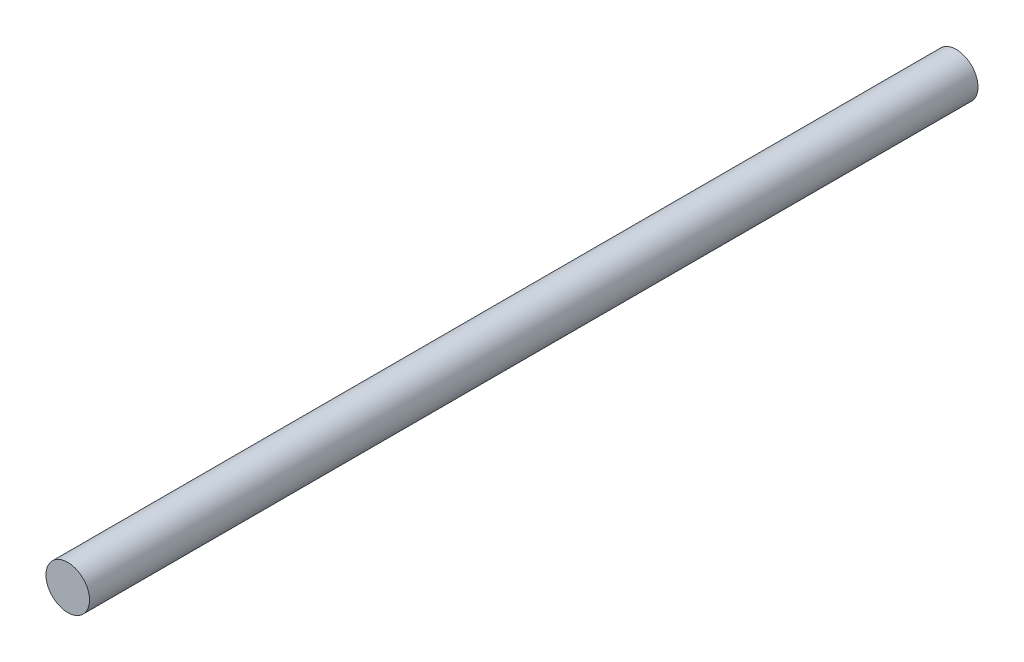
ISO-10303-21;
HEADER;
FILE_DESCRIPTION(('STEP AP214'),'2;1');
FILE_NAME('part.step','',(''),(''),'','','');
FILE_SCHEMA(('AUTOMOTIVE_DESIGN { 1 0 10303 214 1 1 1 1 }'));
ENDSEC;
DATA;
#1=APPLICATION_CONTEXT('core data for automotive mechanical design processes');
#2=APPLICATION_PROTOCOL_DEFINITION('international standard','automotive_design',2000,#1);
#3=PRODUCT_CONTEXT('',#1,'mechanical');
#4=PRODUCT('Part','Part','',(#3));
#5=PRODUCT_RELATED_PRODUCT_CATEGORY('part','',(#4));
#6=PRODUCT_DEFINITION_FORMATION('','',#4);
#7=PRODUCT_DEFINITION_CONTEXT('part definition',#1,'design');
#8=PRODUCT_DEFINITION('design','',#6,#7);
#9=PRODUCT_DEFINITION_SHAPE('','',#8);
#10=(LENGTH_UNIT() NAMED_UNIT(*) SI_UNIT(.MILLI.,.METRE.));
#11=(NAMED_UNIT(*) PLANE_ANGLE_UNIT() SI_UNIT($,.RADIAN.));
#12=(NAMED_UNIT(*) SI_UNIT($,.STERADIAN.) SOLID_ANGLE_UNIT());
#13=UNCERTAINTY_MEASURE_WITH_UNIT(LENGTH_MEASURE(1.E-05),#10,'distance_accuracy_value','');
#14=(GEOMETRIC_REPRESENTATION_CONTEXT(3) GLOBAL_UNCERTAINTY_ASSIGNED_CONTEXT((#13)) GLOBAL_UNIT_ASSIGNED_CONTEXT((#10,
#11,#12)) REPRESENTATION_CONTEXT('',''));
#15=CARTESIAN_POINT('',(0.,0.,0.));
#16=DIRECTION('',(0.,0.,1.));
#17=DIRECTION('',(1.,0.,0.));
#18=AXIS2_PLACEMENT_3D('',#15,#16,#17);
#19=CARTESIAN_POINT('',(0.,0.,-102.));
#20=DIRECTION('',(0.,0.,1.));
#21=DIRECTION('',(1.,0.,0.));
#22=AXIS2_PLACEMENT_3D('',#19,#20,#21);
#23=CYLINDRICAL_SURFACE('',#22,2.5);
#24=CARTESIAN_POINT('',(0.,0.,-102.));
#25=DIRECTION('',(0.,0.,1.));
#26=DIRECTION('',(1.,0.,0.));
#27=AXIS2_PLACEMENT_3D('',#24,#25,#26);
#28=CIRCLE('',#27,2.5);
#29=CARTESIAN_POINT('',(2.5,0.,-102.));
#30=VERTEX_POINT('',#29);
#31=EDGE_CURVE('E10',#30,#30,#28,.T.);
#32=ORIENTED_EDGE('',*,*,#31,.T.);
#33=EDGE_LOOP('',(#32));
#34=FACE_BOUND('',#33,.T.);
#35=CARTESIAN_POINT('',(0.,0.,0.));
#36=DIRECTION('',(0.,0.,1.));
#37=DIRECTION('',(1.,0.,0.));
#38=AXIS2_PLACEMENT_3D('',#35,#36,#37);
#39=CIRCLE('',#38,2.5);
#40=CARTESIAN_POINT('',(2.5,0.,0.));
#41=VERTEX_POINT('',#40);
#42=EDGE_CURVE('E34',#41,#41,#39,.T.);
#43=ORIENTED_EDGE('',*,*,#42,.F.);
#44=EDGE_LOOP('',(#43));
#45=FACE_BOUND('',#44,.T.);
#46=ADVANCED_FACE('F31',(#34,#45),#23,.T.);
#47=CARTESIAN_POINT('',(0.,0.,-102.));
#48=DIRECTION('',(0.,0.,1.));
#49=DIRECTION('',(1.,0.,0.));
#50=AXIS2_PLACEMENT_3D('',#47,#48,#49);
#51=PLANE('',#50);
#52=ORIENTED_EDGE('',*,*,#31,.F.);
#53=EDGE_LOOP('',(#52));
#54=FACE_BOUND('',#53,.T.);
#55=ADVANCED_FACE('F46',(#54),#51,.F.);
#56=CARTESIAN_POINT('',(0.,0.,0.));
#57=DIRECTION('',(0.,0.,1.));
#58=DIRECTION('',(1.,0.,0.));
#59=AXIS2_PLACEMENT_3D('',#56,#57,#58);
#60=PLANE('',#59);
#61=ORIENTED_EDGE('',*,*,#42,.T.);
#62=EDGE_LOOP('',(#61));
#63=FACE_BOUND('',#62,.T.);
#64=ADVANCED_FACE('F43',(#63),#60,.T.);
#65=CLOSED_SHELL('',(#46,#55,#64));
#66=MANIFOLD_SOLID_BREP('B2',#65);
#67=ADVANCED_BREP_SHAPE_REPRESENTATION('',(#18,#66),#14);
#68=SHAPE_DEFINITION_REPRESENTATION(#9,#67);
ENDSEC;
END-ISO-10303-21;
